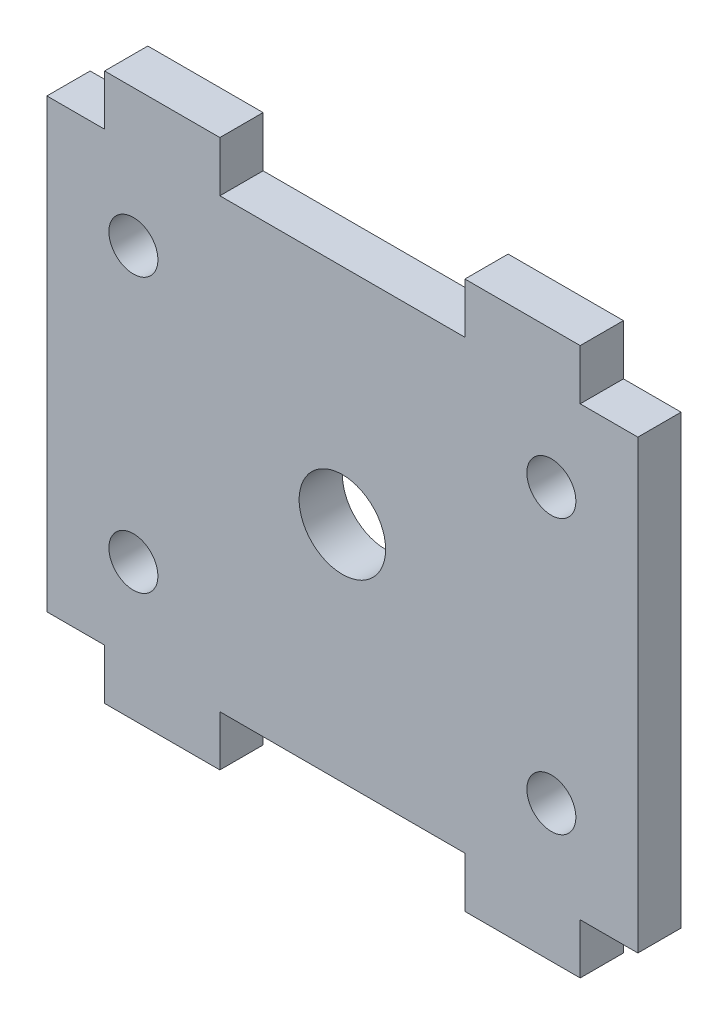
ISO-10303-21;
HEADER;
FILE_DESCRIPTION(('STEP AP214'),'2;1');
FILE_NAME('part.step','',(''),(''),'','','');
FILE_SCHEMA(('AUTOMOTIVE_DESIGN { 1 0 10303 214 1 1 1 1 }'));
ENDSEC;
DATA;
#1=APPLICATION_CONTEXT('core data for automotive mechanical design processes');
#2=APPLICATION_PROTOCOL_DEFINITION('international standard','automotive_design',2000,#1);
#3=PRODUCT_CONTEXT('',#1,'mechanical');
#4=PRODUCT('Part','Part','',(#3));
#5=PRODUCT_RELATED_PRODUCT_CATEGORY('part','',(#4));
#6=PRODUCT_DEFINITION_FORMATION('','',#4);
#7=PRODUCT_DEFINITION_CONTEXT('part definition',#1,'design');
#8=PRODUCT_DEFINITION('design','',#6,#7);
#9=PRODUCT_DEFINITION_SHAPE('','',#8);
#10=(LENGTH_UNIT() NAMED_UNIT(*) SI_UNIT(.MILLI.,.METRE.));
#11=(NAMED_UNIT(*) PLANE_ANGLE_UNIT() SI_UNIT($,.RADIAN.));
#12=(NAMED_UNIT(*) SI_UNIT($,.STERADIAN.) SOLID_ANGLE_UNIT());
#13=UNCERTAINTY_MEASURE_WITH_UNIT(LENGTH_MEASURE(1.E-05),#10,'distance_accuracy_value','');
#14=(GEOMETRIC_REPRESENTATION_CONTEXT(3) GLOBAL_UNCERTAINTY_ASSIGNED_CONTEXT((#13)) GLOBAL_UNIT_ASSIGNED_CONTEXT((#10,
#11,#12)) REPRESENTATION_CONTEXT('',''));
#15=CARTESIAN_POINT('',(0.,0.,0.));
#16=DIRECTION('',(0.,0.,1.));
#17=DIRECTION('',(1.,0.,0.));
#18=AXIS2_PLACEMENT_3D('',#15,#16,#17);
#19=CARTESIAN_POINT('',(0.,0.,3.));
#20=DIRECTION('',(0.,0.,-1.));
#21=DIRECTION('',(-1.,0.,0.));
#22=AXIS2_PLACEMENT_3D('',#19,#20,#21);
#23=PLANE('',#22);
#24=CARTESIAN_POINT('',(-14.5,-9.5,3.));
#25=DIRECTION('',(0.,0.,1.));
#26=DIRECTION('',(1.,0.,0.));
#27=AXIS2_PLACEMENT_3D('',#24,#25,#26);
#28=CIRCLE('',#27,1.7);
#29=CARTESIAN_POINT('',(-12.8,-9.5,3.));
#30=VERTEX_POINT('',#29);
#31=EDGE_CURVE('E365',#30,#30,#28,.T.);
#32=ORIENTED_EDGE('',*,*,#31,.F.);
#33=EDGE_LOOP('',(#32));
#34=FACE_BOUND('',#33,.T.);
#35=CARTESIAN_POINT('',(14.5,9.5,3.));
#36=DIRECTION('',(0.,0.,1.));
#37=DIRECTION('',(1.,0.,0.));
#38=AXIS2_PLACEMENT_3D('',#35,#36,#37);
#39=CIRCLE('',#38,1.7);
#40=CARTESIAN_POINT('',(16.2,9.5,3.));
#41=VERTEX_POINT('',#40);
#42=EDGE_CURVE('E353',#41,#41,#39,.T.);
#43=ORIENTED_EDGE('',*,*,#42,.F.);
#44=EDGE_LOOP('',(#43));
#45=FACE_BOUND('',#44,.T.);
#46=DIRECTION('',(0.,1.,0.));
#47=VECTOR('',#46,1.);
#48=CARTESIAN_POINT('',(-20.5,-15.5,3.));
#49=LINE('',#48,#47);
#50=CARTESIAN_POINT('',(-20.5,-15.5,3.));
#51=VERTEX_POINT('',#50);
#52=CARTESIAN_POINT('',(-20.5,15.5,3.));
#53=VERTEX_POINT('',#52);
#54=EDGE_CURVE('E254',#51,#53,#49,.T.);
#55=ORIENTED_EDGE('',*,*,#54,.F.);
#56=DIRECTION('',(1.,0.,0.));
#57=VECTOR('',#56,1.);
#58=CARTESIAN_POINT('',(-20.5,-15.5,3.));
#59=LINE('',#58,#57);
#60=CARTESIAN_POINT('',(-16.5,-15.5,3.));
#61=VERTEX_POINT('',#60);
#62=EDGE_CURVE('E182',#51,#61,#59,.T.);
#63=ORIENTED_EDGE('',*,*,#62,.T.);
#64=DIRECTION('',(0.,-1.,0.));
#65=VECTOR('',#64,1.);
#66=CARTESIAN_POINT('',(-16.5,-15.5,3.));
#67=LINE('',#66,#65);
#68=CARTESIAN_POINT('',(-16.5,-19.,3.));
#69=VERTEX_POINT('',#68);
#70=EDGE_CURVE('E175',#61,#69,#67,.T.);
#71=ORIENTED_EDGE('',*,*,#70,.T.);
#72=DIRECTION('',(1.,0.,0.));
#73=VECTOR('',#72,1.);
#74=CARTESIAN_POINT('',(-16.5,-19.,3.));
#75=LINE('',#74,#73);
#76=CARTESIAN_POINT('',(-8.5,-19.,3.));
#77=VERTEX_POINT('',#76);
#78=EDGE_CURVE('E180',#69,#77,#75,.T.);
#79=ORIENTED_EDGE('',*,*,#78,.T.);
#80=DIRECTION('',(0.,1.,0.));
#81=VECTOR('',#80,1.);
#82=CARTESIAN_POINT('',(-8.5,-19.,3.));
#83=LINE('',#82,#81);
#84=CARTESIAN_POINT('',(-8.50000000000001,-15.5,3.));
#85=VERTEX_POINT('',#84);
#86=EDGE_CURVE('E197',#77,#85,#83,.T.);
#87=ORIENTED_EDGE('',*,*,#86,.T.);
#88=DIRECTION('',(-1.,0.,0.));
#89=VECTOR('',#88,1.);
#90=CARTESIAN_POINT('',(8.50000000000001,-15.5,3.));
#91=LINE('',#90,#89);
#92=CARTESIAN_POINT('',(8.50000000000001,-15.5,3.));
#93=VERTEX_POINT('',#92);
#94=EDGE_CURVE('E199',#93,#85,#91,.T.);
#95=ORIENTED_EDGE('',*,*,#94,.F.);
#96=DIRECTION('',(0.,1.,0.));
#97=VECTOR('',#96,1.);
#98=CARTESIAN_POINT('',(8.5,-19.,3.));
#99=LINE('',#98,#97);
#100=CARTESIAN_POINT('',(8.5,-19.,3.));
#101=VERTEX_POINT('',#100);
#102=EDGE_CURVE('E304',#101,#93,#99,.T.);
#103=ORIENTED_EDGE('',*,*,#102,.F.);
#104=DIRECTION('',(-1.,0.,0.));
#105=VECTOR('',#104,1.);
#106=CARTESIAN_POINT('',(16.5,-19.,3.));
#107=LINE('',#106,#105);
#108=CARTESIAN_POINT('',(16.5,-19.,3.));
#109=VERTEX_POINT('',#108);
#110=EDGE_CURVE('E311',#109,#101,#107,.T.);
#111=ORIENTED_EDGE('',*,*,#110,.F.);
#112=DIRECTION('',(0.,-1.,0.));
#113=VECTOR('',#112,1.);
#114=CARTESIAN_POINT('',(16.5,-15.5,3.));
#115=LINE('',#114,#113);
#116=CARTESIAN_POINT('',(16.5,-15.5,3.));
#117=VERTEX_POINT('',#116);
#118=EDGE_CURVE('E313',#117,#109,#115,.T.);
#119=ORIENTED_EDGE('',*,*,#118,.F.);
#120=DIRECTION('',(-1.,0.,0.));
#121=VECTOR('',#120,1.);
#122=CARTESIAN_POINT('',(20.5,-15.5,3.));
#123=LINE('',#122,#121);
#124=CARTESIAN_POINT('',(20.5,-15.5,3.));
#125=VERTEX_POINT('',#124);
#126=EDGE_CURVE('E318',#125,#117,#123,.T.);
#127=ORIENTED_EDGE('',*,*,#126,.F.);
#128=DIRECTION('',(0.,1.,0.));
#129=VECTOR('',#128,1.);
#130=CARTESIAN_POINT('',(20.5,-15.5,3.));
#131=LINE('',#130,#129);
#132=CARTESIAN_POINT('',(20.5,15.5,3.));
#133=VERTEX_POINT('',#132);
#134=EDGE_CURVE('E321',#125,#133,#131,.T.);
#135=ORIENTED_EDGE('',*,*,#134,.T.);
#136=DIRECTION('',(-1.,0.,0.));
#137=VECTOR('',#136,1.);
#138=CARTESIAN_POINT('',(20.5,15.5,3.));
#139=LINE('',#138,#137);
#140=CARTESIAN_POINT('',(16.5,15.5,3.));
#141=VERTEX_POINT('',#140);
#142=EDGE_CURVE('E323',#133,#141,#139,.T.);
#143=ORIENTED_EDGE('',*,*,#142,.T.);
#144=DIRECTION('',(0.,1.,0.));
#145=VECTOR('',#144,1.);
#146=CARTESIAN_POINT('',(16.5,15.5,3.));
#147=LINE('',#146,#145);
#148=CARTESIAN_POINT('',(16.5,19.,3.));
#149=VERTEX_POINT('',#148);
#150=EDGE_CURVE('E325',#141,#149,#147,.T.);
#151=ORIENTED_EDGE('',*,*,#150,.T.);
#152=DIRECTION('',(-1.,0.,0.));
#153=VECTOR('',#152,1.);
#154=CARTESIAN_POINT('',(16.5,19.,3.));
#155=LINE('',#154,#153);
#156=CARTESIAN_POINT('',(8.5,19.,3.));
#157=VERTEX_POINT('',#156);
#158=EDGE_CURVE('E327',#149,#157,#155,.T.);
#159=ORIENTED_EDGE('',*,*,#158,.T.);
#160=DIRECTION('',(0.,-1.,0.));
#161=VECTOR('',#160,1.);
#162=CARTESIAN_POINT('',(8.5,19.,3.));
#163=LINE('',#162,#161);
#164=CARTESIAN_POINT('',(8.50000000000001,15.5,3.));
#165=VERTEX_POINT('',#164);
#166=EDGE_CURVE('E329',#157,#165,#163,.T.);
#167=ORIENTED_EDGE('',*,*,#166,.T.);
#168=DIRECTION('',(-1.,0.,0.));
#169=VECTOR('',#168,1.);
#170=CARTESIAN_POINT('',(8.50000000000001,15.5,3.));
#171=LINE('',#170,#169);
#172=CARTESIAN_POINT('',(-8.50000000000001,15.5,3.));
#173=VERTEX_POINT('',#172);
#174=EDGE_CURVE('E331',#165,#173,#171,.T.);
#175=ORIENTED_EDGE('',*,*,#174,.T.);
#176=DIRECTION('',(0.,-1.,0.));
#177=VECTOR('',#176,1.);
#178=CARTESIAN_POINT('',(-8.5,19.,3.));
#179=LINE('',#178,#177);
#180=CARTESIAN_POINT('',(-8.5,19.,3.));
#181=VERTEX_POINT('',#180);
#182=EDGE_CURVE('E333',#181,#173,#179,.T.);
#183=ORIENTED_EDGE('',*,*,#182,.F.);
#184=DIRECTION('',(1.,0.,0.));
#185=VECTOR('',#184,1.);
#186=CARTESIAN_POINT('',(-16.5,19.,3.));
#187=LINE('',#186,#185);
#188=CARTESIAN_POINT('',(-16.5,19.,3.));
#189=VERTEX_POINT('',#188);
#190=EDGE_CURVE('E336',#189,#181,#187,.T.);
#191=ORIENTED_EDGE('',*,*,#190,.F.);
#192=DIRECTION('',(0.,1.,0.));
#193=VECTOR('',#192,1.);
#194=CARTESIAN_POINT('',(-16.5,15.5,3.));
#195=LINE('',#194,#193);
#196=CARTESIAN_POINT('',(-16.5,15.5,3.));
#197=VERTEX_POINT('',#196);
#198=EDGE_CURVE('E339',#197,#189,#195,.T.);
#199=ORIENTED_EDGE('',*,*,#198,.F.);
#200=DIRECTION('',(1.,0.,0.));
#201=VECTOR('',#200,1.);
#202=CARTESIAN_POINT('',(-20.5,15.5,3.));
#203=LINE('',#202,#201);
#204=EDGE_CURVE('E342',#53,#197,#203,.T.);
#205=ORIENTED_EDGE('',*,*,#204,.F.);
#206=EDGE_LOOP('',(#55,#63,#71,#79,#87,#95,#103,#111,#119,#127,#135,#143,#151,#159,#167,#175,
#183,#191,#199,#205));
#207=FACE_BOUND('',#206,.T.);
#208=CARTESIAN_POINT('',(0.,0.,3.));
#209=DIRECTION('',(0.,0.,1.));
#210=DIRECTION('',(1.,0.,0.));
#211=AXIS2_PLACEMENT_3D('',#208,#209,#210);
#212=CIRCLE('',#211,3.);
#213=CARTESIAN_POINT('',(3.,0.,3.));
#214=VERTEX_POINT('',#213);
#215=EDGE_CURVE('E347',#214,#214,#212,.T.);
#216=ORIENTED_EDGE('',*,*,#215,.F.);
#217=EDGE_LOOP('',(#216));
#218=FACE_BOUND('',#217,.T.);
#219=CARTESIAN_POINT('',(-14.5,9.5,3.));
#220=DIRECTION('',(0.,0.,1.));
#221=DIRECTION('',(1.,0.,0.));
#222=AXIS2_PLACEMENT_3D('',#219,#220,#221);
#223=CIRCLE('',#222,1.7);
#224=CARTESIAN_POINT('',(-12.8,9.5,3.));
#225=VERTEX_POINT('',#224);
#226=EDGE_CURVE('E359',#225,#225,#223,.T.);
#227=ORIENTED_EDGE('',*,*,#226,.F.);
#228=EDGE_LOOP('',(#227));
#229=FACE_BOUND('',#228,.T.);
#230=CARTESIAN_POINT('',(14.5,-9.5,3.));
#231=DIRECTION('',(0.,0.,1.));
#232=DIRECTION('',(1.,0.,0.));
#233=AXIS2_PLACEMENT_3D('',#230,#231,#232);
#234=CIRCLE('',#233,1.7);
#235=CARTESIAN_POINT('',(16.2,-9.5,3.));
#236=VERTEX_POINT('',#235);
#237=EDGE_CURVE('E371',#236,#236,#234,.T.);
#238=ORIENTED_EDGE('',*,*,#237,.F.);
#239=EDGE_LOOP('',(#238));
#240=FACE_BOUND('',#239,.T.);
#241=ADVANCED_FACE('F33',(#34,#45,#207,#218,#229,#240),#23,.F.);
#242=CARTESIAN_POINT('',(-20.5,-15.5,3.));
#243=DIRECTION('',(-1.,0.,0.));
#244=DIRECTION('',(0.,-1.,0.));
#245=AXIS2_PLACEMENT_3D('',#242,#243,#244);
#246=PLANE('',#245);
#247=DIRECTION('',(0.,1.,0.));
#248=VECTOR('',#247,1.);
#249=CARTESIAN_POINT('',(-20.5,-15.5,0.));
#250=LINE('',#249,#248);
#251=CARTESIAN_POINT('',(-20.5,-15.5,0.));
#252=VERTEX_POINT('',#251);
#253=CARTESIAN_POINT('',(-20.5,15.5,0.));
#254=VERTEX_POINT('',#253);
#255=EDGE_CURVE('E204',#252,#254,#250,.T.);
#256=ORIENTED_EDGE('',*,*,#255,.F.);
#257=DIRECTION('',(0.,0.,-1.));
#258=VECTOR('',#257,1.);
#259=CARTESIAN_POINT('',(-20.5,-15.5,3.));
#260=LINE('',#259,#258);
#261=EDGE_CURVE('E11',#51,#252,#260,.T.);
#262=ORIENTED_EDGE('',*,*,#261,.F.);
#263=ORIENTED_EDGE('',*,*,#54,.T.);
#264=DIRECTION('',(0.,0.,-1.));
#265=VECTOR('',#264,1.);
#266=CARTESIAN_POINT('',(-20.5,15.5,3.));
#267=LINE('',#266,#265);
#268=EDGE_CURVE('E37',#53,#254,#267,.T.);
#269=ORIENTED_EDGE('',*,*,#268,.T.);
#270=EDGE_LOOP('',(#256,#262,#263,#269));
#271=FACE_BOUND('',#270,.T.);
#272=ADVANCED_FACE('F35',(#271),#246,.T.);
#273=CARTESIAN_POINT('',(-20.5,-15.5,3.));
#274=DIRECTION('',(0.,1.,0.));
#275=DIRECTION('',(0.,0.,1.));
#276=AXIS2_PLACEMENT_3D('',#273,#274,#275);
#277=PLANE('',#276);
#278=DIRECTION('',(1.,0.,0.));
#279=VECTOR('',#278,1.);
#280=CARTESIAN_POINT('',(-20.5,-15.5,0.));
#281=LINE('',#280,#279);
#282=CARTESIAN_POINT('',(-16.5,-15.5,0.));
#283=VERTEX_POINT('',#282);
#284=EDGE_CURVE('E115',#252,#283,#281,.T.);
#285=ORIENTED_EDGE('',*,*,#284,.T.);
#286=DIRECTION('',(0.,0.,-1.));
#287=VECTOR('',#286,1.);
#288=CARTESIAN_POINT('',(-16.5,-15.5,3.));
#289=LINE('',#288,#287);
#290=EDGE_CURVE('E43',#61,#283,#289,.T.);
#291=ORIENTED_EDGE('',*,*,#290,.F.);
#292=ORIENTED_EDGE('',*,*,#62,.F.);
#293=ORIENTED_EDGE('',*,*,#261,.T.);
#294=EDGE_LOOP('',(#285,#291,#292,#293));
#295=FACE_BOUND('',#294,.T.);
#296=ADVANCED_FACE('F386',(#295),#277,.F.);
#297=CARTESIAN_POINT('',(-16.5,-15.5,3.));
#298=DIRECTION('',(1.,0.,0.));
#299=DIRECTION('',(0.,1.,0.));
#300=AXIS2_PLACEMENT_3D('',#297,#298,#299);
#301=PLANE('',#300);
#302=DIRECTION('',(0.,-1.,0.));
#303=VECTOR('',#302,1.);
#304=CARTESIAN_POINT('',(-16.5,-15.5,0.));
#305=LINE('',#304,#303);
#306=CARTESIAN_POINT('',(-16.5,-19.,0.));
#307=VERTEX_POINT('',#306);
#308=EDGE_CURVE('E189',#283,#307,#305,.T.);
#309=ORIENTED_EDGE('',*,*,#308,.T.);
#310=DIRECTION('',(0.,0.,-1.));
#311=VECTOR('',#310,1.);
#312=CARTESIAN_POINT('',(-16.5,-19.,3.));
#313=LINE('',#312,#311);
#314=EDGE_CURVE('E186',#69,#307,#313,.T.);
#315=ORIENTED_EDGE('',*,*,#314,.F.);
#316=ORIENTED_EDGE('',*,*,#70,.F.);
#317=ORIENTED_EDGE('',*,*,#290,.T.);
#318=EDGE_LOOP('',(#309,#315,#316,#317));
#319=FACE_BOUND('',#318,.T.);
#320=ADVANCED_FACE('F187',(#319),#301,.F.);
#321=CARTESIAN_POINT('',(-16.5,-19.,3.));
#322=DIRECTION('',(0.,1.,0.));
#323=DIRECTION('',(-1.,0.,0.));
#324=AXIS2_PLACEMENT_3D('',#321,#322,#323);
#325=PLANE('',#324);
#326=DIRECTION('',(1.,0.,0.));
#327=VECTOR('',#326,1.);
#328=CARTESIAN_POINT('',(-16.5,-19.,0.));
#329=LINE('',#328,#327);
#330=CARTESIAN_POINT('',(-8.5,-19.,0.));
#331=VERTEX_POINT('',#330);
#332=EDGE_CURVE('E251',#307,#331,#329,.T.);
#333=ORIENTED_EDGE('',*,*,#332,.T.);
#334=DIRECTION('',(0.,0.,-1.));
#335=VECTOR('',#334,1.);
#336=CARTESIAN_POINT('',(-8.5,-19.,3.));
#337=LINE('',#336,#335);
#338=EDGE_CURVE('E192',#77,#331,#337,.T.);
#339=ORIENTED_EDGE('',*,*,#338,.F.);
#340=ORIENTED_EDGE('',*,*,#78,.F.);
#341=ORIENTED_EDGE('',*,*,#314,.T.);
#342=EDGE_LOOP('',(#333,#339,#340,#341));
#343=FACE_BOUND('',#342,.T.);
#344=ADVANCED_FACE('F194',(#343),#325,.F.);
#345=CARTESIAN_POINT('',(-8.5,-19.,3.));
#346=DIRECTION('',(-1.,0.,0.));
#347=DIRECTION('',(0.,-1.,0.));
#348=AXIS2_PLACEMENT_3D('',#345,#346,#347);
#349=PLANE('',#348);
#350=DIRECTION('',(0.,1.,0.));
#351=VECTOR('',#350,1.);
#352=CARTESIAN_POINT('',(-8.5,-19.,0.));
#353=LINE('',#352,#351);
#354=CARTESIAN_POINT('',(-8.50000000000001,-15.5,0.));
#355=VERTEX_POINT('',#354);
#356=EDGE_CURVE('E248',#331,#355,#353,.T.);
#357=ORIENTED_EDGE('',*,*,#356,.T.);
#358=DIRECTION('',(0.,0.,-1.));
#359=VECTOR('',#358,1.);
#360=CARTESIAN_POINT('',(-8.50000000000001,-15.5,3.));
#361=LINE('',#360,#359);
#362=EDGE_CURVE('E258',#85,#355,#361,.T.);
#363=ORIENTED_EDGE('',*,*,#362,.F.);
#364=ORIENTED_EDGE('',*,*,#86,.F.);
#365=ORIENTED_EDGE('',*,*,#338,.T.);
#366=EDGE_LOOP('',(#357,#363,#364,#365));
#367=FACE_BOUND('',#366,.T.);
#368=ADVANCED_FACE('F297',(#367),#349,.F.);
#369=CARTESIAN_POINT('',(8.50000000000001,-15.5,3.));
#370=DIRECTION('',(0.,-1.,0.));
#371=DIRECTION('',(0.,0.,-1.));
#372=AXIS2_PLACEMENT_3D('',#369,#370,#371);
#373=PLANE('',#372);
#374=DIRECTION('',(-1.,0.,0.));
#375=VECTOR('',#374,1.);
#376=CARTESIAN_POINT('',(8.50000000000001,-15.5,0.));
#377=LINE('',#376,#375);
#378=CARTESIAN_POINT('',(8.50000000000001,-15.5,0.));
#379=VERTEX_POINT('',#378);
#380=EDGE_CURVE('E245',#379,#355,#377,.T.);
#381=ORIENTED_EDGE('',*,*,#380,.F.);
#382=DIRECTION('',(0.,0.,-1.));
#383=VECTOR('',#382,1.);
#384=CARTESIAN_POINT('',(8.50000000000001,-15.5,3.));
#385=LINE('',#384,#383);
#386=EDGE_CURVE('E260',#93,#379,#385,.T.);
#387=ORIENTED_EDGE('',*,*,#386,.F.);
#388=ORIENTED_EDGE('',*,*,#94,.T.);
#389=ORIENTED_EDGE('',*,*,#362,.T.);
#390=EDGE_LOOP('',(#381,#387,#388,#389));
#391=FACE_BOUND('',#390,.T.);
#392=ADVANCED_FACE('F403',(#391),#373,.T.);
#393=CARTESIAN_POINT('',(8.5,-19.,3.));
#394=DIRECTION('',(-1.,0.,0.));
#395=DIRECTION('',(0.,-1.,0.));
#396=AXIS2_PLACEMENT_3D('',#393,#394,#395);
#397=PLANE('',#396);
#398=DIRECTION('',(0.,1.,0.));
#399=VECTOR('',#398,1.);
#400=CARTESIAN_POINT('',(8.5,-19.,0.));
#401=LINE('',#400,#399);
#402=CARTESIAN_POINT('',(8.5,-19.,0.));
#403=VERTEX_POINT('',#402);
#404=EDGE_CURVE('E242',#403,#379,#401,.T.);
#405=ORIENTED_EDGE('',*,*,#404,.F.);
#406=DIRECTION('',(0.,0.,-1.));
#407=VECTOR('',#406,1.);
#408=CARTESIAN_POINT('',(8.5,-19.,3.));
#409=LINE('',#408,#407);
#410=EDGE_CURVE('E262',#101,#403,#409,.T.);
#411=ORIENTED_EDGE('',*,*,#410,.F.);
#412=ORIENTED_EDGE('',*,*,#102,.T.);
#413=ORIENTED_EDGE('',*,*,#386,.T.);
#414=EDGE_LOOP('',(#405,#411,#412,#413));
#415=FACE_BOUND('',#414,.T.);
#416=ADVANCED_FACE('F309',(#415),#397,.T.);
#417=CARTESIAN_POINT('',(16.5,-19.,3.));
#418=DIRECTION('',(0.,-1.,0.));
#419=DIRECTION('',(1.,0.,0.));
#420=AXIS2_PLACEMENT_3D('',#417,#418,#419);
#421=PLANE('',#420);
#422=DIRECTION('',(-1.,0.,0.));
#423=VECTOR('',#422,1.);
#424=CARTESIAN_POINT('',(16.5,-19.,0.));
#425=LINE('',#424,#423);
#426=CARTESIAN_POINT('',(16.5,-19.,0.));
#427=VERTEX_POINT('',#426);
#428=EDGE_CURVE('E239',#427,#403,#425,.T.);
#429=ORIENTED_EDGE('',*,*,#428,.F.);
#430=DIRECTION('',(0.,0.,-1.));
#431=VECTOR('',#430,1.);
#432=CARTESIAN_POINT('',(16.5,-19.,3.));
#433=LINE('',#432,#431);
#434=EDGE_CURVE('E264',#109,#427,#433,.T.);
#435=ORIENTED_EDGE('',*,*,#434,.F.);
#436=ORIENTED_EDGE('',*,*,#110,.T.);
#437=ORIENTED_EDGE('',*,*,#410,.T.);
#438=EDGE_LOOP('',(#429,#435,#436,#437));
#439=FACE_BOUND('',#438,.T.);
#440=ADVANCED_FACE('F408',(#439),#421,.T.);
#441=CARTESIAN_POINT('',(16.5,-15.5,3.));
#442=DIRECTION('',(1.,0.,0.));
#443=DIRECTION('',(0.,1.,0.));
#444=AXIS2_PLACEMENT_3D('',#441,#442,#443);
#445=PLANE('',#444);
#446=DIRECTION('',(0.,-1.,0.));
#447=VECTOR('',#446,1.);
#448=CARTESIAN_POINT('',(16.5,-15.5,0.));
#449=LINE('',#448,#447);
#450=CARTESIAN_POINT('',(16.5,-15.5,0.));
#451=VERTEX_POINT('',#450);
#452=EDGE_CURVE('E236',#451,#427,#449,.T.);
#453=ORIENTED_EDGE('',*,*,#452,.F.);
#454=DIRECTION('',(0.,0.,-1.));
#455=VECTOR('',#454,1.);
#456=CARTESIAN_POINT('',(16.5,-15.5,3.));
#457=LINE('',#456,#455);
#458=EDGE_CURVE('E266',#117,#451,#457,.T.);
#459=ORIENTED_EDGE('',*,*,#458,.F.);
#460=ORIENTED_EDGE('',*,*,#118,.T.);
#461=ORIENTED_EDGE('',*,*,#434,.T.);
#462=EDGE_LOOP('',(#453,#459,#460,#461));
#463=FACE_BOUND('',#462,.T.);
#464=ADVANCED_FACE('F411',(#463),#445,.T.);
#465=CARTESIAN_POINT('',(20.5,-15.5,3.));
#466=DIRECTION('',(0.,-1.,0.));
#467=DIRECTION('',(0.,0.,-1.));
#468=AXIS2_PLACEMENT_3D('',#465,#466,#467);
#469=PLANE('',#468);
#470=DIRECTION('',(-1.,0.,0.));
#471=VECTOR('',#470,1.);
#472=CARTESIAN_POINT('',(20.5,-15.5,0.));
#473=LINE('',#472,#471);
#474=CARTESIAN_POINT('',(20.5,-15.5,0.));
#475=VERTEX_POINT('',#474);
#476=EDGE_CURVE('E233',#475,#451,#473,.T.);
#477=ORIENTED_EDGE('',*,*,#476,.F.);
#478=DIRECTION('',(0.,0.,-1.));
#479=VECTOR('',#478,1.);
#480=CARTESIAN_POINT('',(20.5,-15.5,3.));
#481=LINE('',#480,#479);
#482=EDGE_CURVE('E268',#125,#475,#481,.T.);
#483=ORIENTED_EDGE('',*,*,#482,.F.);
#484=ORIENTED_EDGE('',*,*,#126,.T.);
#485=ORIENTED_EDGE('',*,*,#458,.T.);
#486=EDGE_LOOP('',(#477,#483,#484,#485));
#487=FACE_BOUND('',#486,.T.);
#488=ADVANCED_FACE('F415',(#487),#469,.T.);
#489=CARTESIAN_POINT('',(20.5,-15.5,3.));
#490=DIRECTION('',(-1.,0.,0.));
#491=DIRECTION('',(0.,0.,1.));
#492=AXIS2_PLACEMENT_3D('',#489,#490,#491);
#493=PLANE('',#492);
#494=DIRECTION('',(0.,1.,0.));
#495=VECTOR('',#494,1.);
#496=CARTESIAN_POINT('',(20.5,-15.5,0.));
#497=LINE('',#496,#495);
#498=CARTESIAN_POINT('',(20.5,15.5,0.));
#499=VERTEX_POINT('',#498);
#500=EDGE_CURVE('E231',#475,#499,#497,.T.);
#501=ORIENTED_EDGE('',*,*,#500,.T.);
#502=DIRECTION('',(0.,0.,-1.));
#503=VECTOR('',#502,1.);
#504=CARTESIAN_POINT('',(20.5,15.5,3.));
#505=LINE('',#504,#503);
#506=EDGE_CURVE('E270',#133,#499,#505,.T.);
#507=ORIENTED_EDGE('',*,*,#506,.F.);
#508=ORIENTED_EDGE('',*,*,#134,.F.);
#509=ORIENTED_EDGE('',*,*,#482,.T.);
#510=EDGE_LOOP('',(#501,#507,#508,#509));
#511=FACE_BOUND('',#510,.T.);
#512=ADVANCED_FACE('F419',(#511),#493,.F.);
#513=CARTESIAN_POINT('',(20.5,15.5,3.));
#514=DIRECTION('',(0.,-1.,0.));
#515=DIRECTION('',(0.,0.,-1.));
#516=AXIS2_PLACEMENT_3D('',#513,#514,#515);
#517=PLANE('',#516);
#518=DIRECTION('',(-1.,0.,0.));
#519=VECTOR('',#518,1.);
#520=CARTESIAN_POINT('',(20.5,15.5,0.));
#521=LINE('',#520,#519);
#522=CARTESIAN_POINT('',(16.5,15.5,0.));
#523=VERTEX_POINT('',#522);
#524=EDGE_CURVE('E229',#499,#523,#521,.T.);
#525=ORIENTED_EDGE('',*,*,#524,.T.);
#526=DIRECTION('',(0.,0.,-1.));
#527=VECTOR('',#526,1.);
#528=CARTESIAN_POINT('',(16.5,15.5,3.));
#529=LINE('',#528,#527);
#530=EDGE_CURVE('E273',#141,#523,#529,.T.);
#531=ORIENTED_EDGE('',*,*,#530,.F.);
#532=ORIENTED_EDGE('',*,*,#142,.F.);
#533=ORIENTED_EDGE('',*,*,#506,.T.);
#534=EDGE_LOOP('',(#525,#531,#532,#533));
#535=FACE_BOUND('',#534,.T.);
#536=ADVANCED_FACE('F423',(#535),#517,.F.);
#537=CARTESIAN_POINT('',(16.5,15.5,3.));
#538=DIRECTION('',(-1.,0.,0.));
#539=DIRECTION('',(0.,-1.,0.));
#540=AXIS2_PLACEMENT_3D('',#537,#538,#539);
#541=PLANE('',#540);
#542=DIRECTION('',(0.,1.,0.));
#543=VECTOR('',#542,1.);
#544=CARTESIAN_POINT('',(16.5,15.5,0.));
#545=LINE('',#544,#543);
#546=CARTESIAN_POINT('',(16.5,19.,0.));
#547=VERTEX_POINT('',#546);
#548=EDGE_CURVE('E227',#523,#547,#545,.T.);
#549=ORIENTED_EDGE('',*,*,#548,.T.);
#550=DIRECTION('',(0.,0.,-1.));
#551=VECTOR('',#550,1.);
#552=CARTESIAN_POINT('',(16.5,19.,3.));
#553=LINE('',#552,#551);
#554=EDGE_CURVE('E276',#149,#547,#553,.T.);
#555=ORIENTED_EDGE('',*,*,#554,.F.);
#556=ORIENTED_EDGE('',*,*,#150,.F.);
#557=ORIENTED_EDGE('',*,*,#530,.T.);
#558=EDGE_LOOP('',(#549,#555,#556,#557));
#559=FACE_BOUND('',#558,.T.);
#560=ADVANCED_FACE('F427',(#559),#541,.F.);
#561=CARTESIAN_POINT('',(16.5,19.,3.));
#562=DIRECTION('',(0.,-1.,0.));
#563=DIRECTION('',(1.,0.,0.));
#564=AXIS2_PLACEMENT_3D('',#561,#562,#563);
#565=PLANE('',#564);
#566=DIRECTION('',(-1.,0.,0.));
#567=VECTOR('',#566,1.);
#568=CARTESIAN_POINT('',(16.5,19.,0.));
#569=LINE('',#568,#567);
#570=CARTESIAN_POINT('',(8.5,19.,0.));
#571=VERTEX_POINT('',#570);
#572=EDGE_CURVE('E225',#547,#571,#569,.T.);
#573=ORIENTED_EDGE('',*,*,#572,.T.);
#574=DIRECTION('',(0.,0.,-1.));
#575=VECTOR('',#574,1.);
#576=CARTESIAN_POINT('',(8.5,19.,3.));
#577=LINE('',#576,#575);
#578=EDGE_CURVE('E279',#157,#571,#577,.T.);
#579=ORIENTED_EDGE('',*,*,#578,.F.);
#580=ORIENTED_EDGE('',*,*,#158,.F.);
#581=ORIENTED_EDGE('',*,*,#554,.T.);
#582=EDGE_LOOP('',(#573,#579,#580,#581));
#583=FACE_BOUND('',#582,.T.);
#584=ADVANCED_FACE('F431',(#583),#565,.F.);
#585=CARTESIAN_POINT('',(8.5,19.,3.));
#586=DIRECTION('',(1.,0.,0.));
#587=DIRECTION('',(0.,1.,0.));
#588=AXIS2_PLACEMENT_3D('',#585,#586,#587);
#589=PLANE('',#588);
#590=DIRECTION('',(0.,-1.,0.));
#591=VECTOR('',#590,1.);
#592=CARTESIAN_POINT('',(8.5,19.,0.));
#593=LINE('',#592,#591);
#594=CARTESIAN_POINT('',(8.50000000000001,15.5,0.));
#595=VERTEX_POINT('',#594);
#596=EDGE_CURVE('E223',#571,#595,#593,.T.);
#597=ORIENTED_EDGE('',*,*,#596,.T.);
#598=DIRECTION('',(0.,0.,-1.));
#599=VECTOR('',#598,1.);
#600=CARTESIAN_POINT('',(8.50000000000001,15.5,3.));
#601=LINE('',#600,#599);
#602=EDGE_CURVE('E282',#165,#595,#601,.T.);
#603=ORIENTED_EDGE('',*,*,#602,.F.);
#604=ORIENTED_EDGE('',*,*,#166,.F.);
#605=ORIENTED_EDGE('',*,*,#578,.T.);
#606=EDGE_LOOP('',(#597,#603,#604,#605));
#607=FACE_BOUND('',#606,.T.);
#608=ADVANCED_FACE('F435',(#607),#589,.F.);
#609=CARTESIAN_POINT('',(8.50000000000001,15.5,3.));
#610=DIRECTION('',(0.,-1.,0.));
#611=DIRECTION('',(1.,0.,0.));
#612=AXIS2_PLACEMENT_3D('',#609,#610,#611);
#613=PLANE('',#612);
#614=DIRECTION('',(-1.,0.,0.));
#615=VECTOR('',#614,1.);
#616=CARTESIAN_POINT('',(8.50000000000001,15.5,0.));
#617=LINE('',#616,#615);
#618=CARTESIAN_POINT('',(-8.50000000000001,15.5,0.));
#619=VERTEX_POINT('',#618);
#620=EDGE_CURVE('E220',#595,#619,#617,.T.);
#621=ORIENTED_EDGE('',*,*,#620,.T.);
#622=DIRECTION('',(0.,0.,-1.));
#623=VECTOR('',#622,1.);
#624=CARTESIAN_POINT('',(-8.50000000000001,15.5,3.));
#625=LINE('',#624,#623);
#626=EDGE_CURVE('E285',#173,#619,#625,.T.);
#627=ORIENTED_EDGE('',*,*,#626,.F.);
#628=ORIENTED_EDGE('',*,*,#174,.F.);
#629=ORIENTED_EDGE('',*,*,#602,.T.);
#630=EDGE_LOOP('',(#621,#627,#628,#629));
#631=FACE_BOUND('',#630,.T.);
#632=ADVANCED_FACE('F439',(#631),#613,.F.);
#633=CARTESIAN_POINT('',(-8.5,19.,3.));
#634=DIRECTION('',(1.,0.,0.));
#635=DIRECTION('',(0.,1.,0.));
#636=AXIS2_PLACEMENT_3D('',#633,#634,#635);
#637=PLANE('',#636);
#638=DIRECTION('',(0.,-1.,0.));
#639=VECTOR('',#638,1.);
#640=CARTESIAN_POINT('',(-8.5,19.,0.));
#641=LINE('',#640,#639);
#642=CARTESIAN_POINT('',(-8.5,19.,0.));
#643=VERTEX_POINT('',#642);
#644=EDGE_CURVE('E217',#643,#619,#641,.T.);
#645=ORIENTED_EDGE('',*,*,#644,.F.);
#646=DIRECTION('',(0.,0.,-1.));
#647=VECTOR('',#646,1.);
#648=CARTESIAN_POINT('',(-8.5,19.,3.));
#649=LINE('',#648,#647);
#650=EDGE_CURVE('E287',#181,#643,#649,.T.);
#651=ORIENTED_EDGE('',*,*,#650,.F.);
#652=ORIENTED_EDGE('',*,*,#182,.T.);
#653=ORIENTED_EDGE('',*,*,#626,.T.);
#654=EDGE_LOOP('',(#645,#651,#652,#653));
#655=FACE_BOUND('',#654,.T.);
#656=ADVANCED_FACE('F443',(#655),#637,.T.);
#657=CARTESIAN_POINT('',(-16.5,19.,3.));
#658=DIRECTION('',(0.,1.,0.));
#659=DIRECTION('',(0.,0.,1.));
#660=AXIS2_PLACEMENT_3D('',#657,#658,#659);
#661=PLANE('',#660);
#662=DIRECTION('',(1.,0.,0.));
#663=VECTOR('',#662,1.);
#664=CARTESIAN_POINT('',(-16.5,19.,0.));
#665=LINE('',#664,#663);
#666=CARTESIAN_POINT('',(-16.5,19.,0.));
#667=VERTEX_POINT('',#666);
#668=EDGE_CURVE('E214',#667,#643,#665,.T.);
#669=ORIENTED_EDGE('',*,*,#668,.F.);
#670=DIRECTION('',(0.,0.,-1.));
#671=VECTOR('',#670,1.);
#672=CARTESIAN_POINT('',(-16.5,19.,3.));
#673=LINE('',#672,#671);
#674=EDGE_CURVE('E289',#189,#667,#673,.T.);
#675=ORIENTED_EDGE('',*,*,#674,.F.);
#676=ORIENTED_EDGE('',*,*,#190,.T.);
#677=ORIENTED_EDGE('',*,*,#650,.T.);
#678=EDGE_LOOP('',(#669,#675,#676,#677));
#679=FACE_BOUND('',#678,.T.);
#680=ADVANCED_FACE('F447',(#679),#661,.T.);
#681=CARTESIAN_POINT('',(-16.5,15.5,3.));
#682=DIRECTION('',(-1.,0.,0.));
#683=DIRECTION('',(0.,-1.,0.));
#684=AXIS2_PLACEMENT_3D('',#681,#682,#683);
#685=PLANE('',#684);
#686=DIRECTION('',(0.,1.,0.));
#687=VECTOR('',#686,1.);
#688=CARTESIAN_POINT('',(-16.5,15.5,0.));
#689=LINE('',#688,#687);
#690=CARTESIAN_POINT('',(-16.5,15.5,0.));
#691=VERTEX_POINT('',#690);
#692=EDGE_CURVE('E211',#691,#667,#689,.T.);
#693=ORIENTED_EDGE('',*,*,#692,.F.);
#694=DIRECTION('',(0.,0.,-1.));
#695=VECTOR('',#694,1.);
#696=CARTESIAN_POINT('',(-16.5,15.5,3.));
#697=LINE('',#696,#695);
#698=EDGE_CURVE('E290',#197,#691,#697,.T.);
#699=ORIENTED_EDGE('',*,*,#698,.F.);
#700=ORIENTED_EDGE('',*,*,#198,.T.);
#701=ORIENTED_EDGE('',*,*,#674,.T.);
#702=EDGE_LOOP('',(#693,#699,#700,#701));
#703=FACE_BOUND('',#702,.T.);
#704=ADVANCED_FACE('F451',(#703),#685,.T.);
#705=CARTESIAN_POINT('',(-20.5,15.5,3.));
#706=DIRECTION('',(0.,1.,0.));
#707=DIRECTION('',(-1.,0.,0.));
#708=AXIS2_PLACEMENT_3D('',#705,#706,#707);
#709=PLANE('',#708);
#710=DIRECTION('',(1.,0.,0.));
#711=VECTOR('',#710,1.);
#712=CARTESIAN_POINT('',(-20.5,15.5,0.));
#713=LINE('',#712,#711);
#714=EDGE_CURVE('E207',#254,#691,#713,.T.);
#715=ORIENTED_EDGE('',*,*,#714,.F.);
#716=ORIENTED_EDGE('',*,*,#268,.F.);
#717=ORIENTED_EDGE('',*,*,#204,.T.);
#718=ORIENTED_EDGE('',*,*,#698,.T.);
#719=EDGE_LOOP('',(#715,#716,#717,#718));
#720=FACE_BOUND('',#719,.T.);
#721=ADVANCED_FACE('F292',(#720),#709,.T.);
#722=CARTESIAN_POINT('',(0.,0.,0.));
#723=DIRECTION('',(0.,0.,-1.));
#724=DIRECTION('',(-1.,0.,0.));
#725=AXIS2_PLACEMENT_3D('',#722,#723,#724);
#726=PLANE('',#725);
#727=CARTESIAN_POINT('',(14.5,-9.5,0.));
#728=DIRECTION('',(0.,0.,-1.));
#729=DIRECTION('',(-1.,0.,0.));
#730=AXIS2_PLACEMENT_3D('',#727,#728,#729);
#731=CIRCLE('',#730,1.7);
#732=CARTESIAN_POINT('',(12.8,-9.5,0.));
#733=VERTEX_POINT('',#732);
#734=EDGE_CURVE('E368',#733,#733,#731,.T.);
#735=ORIENTED_EDGE('',*,*,#734,.F.);
#736=EDGE_LOOP('',(#735));
#737=FACE_BOUND('',#736,.T.);
#738=CARTESIAN_POINT('',(-14.5,-9.5,0.));
#739=DIRECTION('',(0.,0.,-1.));
#740=DIRECTION('',(-1.,0.,0.));
#741=AXIS2_PLACEMENT_3D('',#738,#739,#740);
#742=CIRCLE('',#741,1.7);
#743=CARTESIAN_POINT('',(-16.2,-9.5,0.));
#744=VERTEX_POINT('',#743);
#745=EDGE_CURVE('E362',#744,#744,#742,.T.);
#746=ORIENTED_EDGE('',*,*,#745,.F.);
#747=EDGE_LOOP('',(#746));
#748=FACE_BOUND('',#747,.T.);
#749=CARTESIAN_POINT('',(-14.5,9.5,0.));
#750=DIRECTION('',(0.,0.,-1.));
#751=DIRECTION('',(-1.,0.,0.));
#752=AXIS2_PLACEMENT_3D('',#749,#750,#751);
#753=CIRCLE('',#752,1.7);
#754=CARTESIAN_POINT('',(-16.2,9.5,0.));
#755=VERTEX_POINT('',#754);
#756=EDGE_CURVE('E356',#755,#755,#753,.T.);
#757=ORIENTED_EDGE('',*,*,#756,.F.);
#758=EDGE_LOOP('',(#757));
#759=FACE_BOUND('',#758,.T.);
#760=CARTESIAN_POINT('',(14.5,9.5,0.));
#761=DIRECTION('',(0.,0.,-1.));
#762=DIRECTION('',(-1.,0.,0.));
#763=AXIS2_PLACEMENT_3D('',#760,#761,#762);
#764=CIRCLE('',#763,1.7);
#765=CARTESIAN_POINT('',(12.8,9.5,0.));
#766=VERTEX_POINT('',#765);
#767=EDGE_CURVE('E350',#766,#766,#764,.T.);
#768=ORIENTED_EDGE('',*,*,#767,.F.);
#769=EDGE_LOOP('',(#768));
#770=FACE_BOUND('',#769,.T.);
#771=CARTESIAN_POINT('',(0.,0.,0.));
#772=DIRECTION('',(0.,0.,-1.));
#773=DIRECTION('',(-1.,0.,0.));
#774=AXIS2_PLACEMENT_3D('',#771,#772,#773);
#775=CIRCLE('',#774,3.);
#776=CARTESIAN_POINT('',(-3.,0.,0.));
#777=VERTEX_POINT('',#776);
#778=EDGE_CURVE('E208',#777,#777,#775,.T.);
#779=ORIENTED_EDGE('',*,*,#778,.F.);
#780=EDGE_LOOP('',(#779));
#781=FACE_BOUND('',#780,.T.);
#782=ORIENTED_EDGE('',*,*,#255,.T.);
#783=ORIENTED_EDGE('',*,*,#714,.T.);
#784=ORIENTED_EDGE('',*,*,#692,.T.);
#785=ORIENTED_EDGE('',*,*,#668,.T.);
#786=ORIENTED_EDGE('',*,*,#644,.T.);
#787=ORIENTED_EDGE('',*,*,#620,.F.);
#788=ORIENTED_EDGE('',*,*,#596,.F.);
#789=ORIENTED_EDGE('',*,*,#572,.F.);
#790=ORIENTED_EDGE('',*,*,#548,.F.);
#791=ORIENTED_EDGE('',*,*,#524,.F.);
#792=ORIENTED_EDGE('',*,*,#500,.F.);
#793=ORIENTED_EDGE('',*,*,#476,.T.);
#794=ORIENTED_EDGE('',*,*,#452,.T.);
#795=ORIENTED_EDGE('',*,*,#428,.T.);
#796=ORIENTED_EDGE('',*,*,#404,.T.);
#797=ORIENTED_EDGE('',*,*,#380,.T.);
#798=ORIENTED_EDGE('',*,*,#356,.F.);
#799=ORIENTED_EDGE('',*,*,#332,.F.);
#800=ORIENTED_EDGE('',*,*,#308,.F.);
#801=ORIENTED_EDGE('',*,*,#284,.F.);
#802=EDGE_LOOP('',(#782,#783,#784,#785,#786,#787,#788,#789,#790,#791,#792,#793,#794,#795,#796,
#797,#798,#799,#800,#801));
#803=FACE_BOUND('',#802,.T.);
#804=ADVANCED_FACE('F294',(#737,#748,#759,#770,#781,#803),#726,.T.);
#805=CARTESIAN_POINT('',(0.,0.,3.));
#806=DIRECTION('',(0.,0.,1.));
#807=DIRECTION('',(1.,0.,0.));
#808=AXIS2_PLACEMENT_3D('',#805,#806,#807);
#809=CYLINDRICAL_SURFACE('',#808,3.);
#810=ORIENTED_EDGE('',*,*,#215,.T.);
#811=EDGE_LOOP('',(#810));
#812=FACE_BOUND('',#811,.T.);
#813=ORIENTED_EDGE('',*,*,#778,.T.);
#814=EDGE_LOOP('',(#813));
#815=FACE_BOUND('',#814,.T.);
#816=ADVANCED_FACE('F391',(#812,#815),#809,.F.);
#817=CARTESIAN_POINT('',(14.5,9.5,3.));
#818=DIRECTION('',(0.,0.,1.));
#819=DIRECTION('',(1.,0.,0.));
#820=AXIS2_PLACEMENT_3D('',#817,#818,#819);
#821=CYLINDRICAL_SURFACE('',#820,1.7);
#822=ORIENTED_EDGE('',*,*,#42,.T.);
#823=EDGE_LOOP('',(#822));
#824=FACE_BOUND('',#823,.T.);
#825=ORIENTED_EDGE('',*,*,#767,.T.);
#826=EDGE_LOOP('',(#825));
#827=FACE_BOUND('',#826,.T.);
#828=ADVANCED_FACE('F474',(#824,#827),#821,.F.);
#829=CARTESIAN_POINT('',(-14.5,9.5,3.));
#830=DIRECTION('',(0.,0.,1.));
#831=DIRECTION('',(1.,0.,0.));
#832=AXIS2_PLACEMENT_3D('',#829,#830,#831);
#833=CYLINDRICAL_SURFACE('',#832,1.7);
#834=ORIENTED_EDGE('',*,*,#226,.T.);
#835=EDGE_LOOP('',(#834));
#836=FACE_BOUND('',#835,.T.);
#837=ORIENTED_EDGE('',*,*,#756,.T.);
#838=EDGE_LOOP('',(#837));
#839=FACE_BOUND('',#838,.T.);
#840=ADVANCED_FACE('F480',(#836,#839),#833,.F.);
#841=CARTESIAN_POINT('',(-14.5,-9.5,3.));
#842=DIRECTION('',(0.,0.,1.));
#843=DIRECTION('',(1.,0.,0.));
#844=AXIS2_PLACEMENT_3D('',#841,#842,#843);
#845=CYLINDRICAL_SURFACE('',#844,1.7);
#846=ORIENTED_EDGE('',*,*,#31,.T.);
#847=EDGE_LOOP('',(#846));
#848=FACE_BOUND('',#847,.T.);
#849=ORIENTED_EDGE('',*,*,#745,.T.);
#850=EDGE_LOOP('',(#849));
#851=FACE_BOUND('',#850,.T.);
#852=ADVANCED_FACE('F492',(#848,#851),#845,.F.);
#853=CARTESIAN_POINT('',(14.5,-9.5,3.));
#854=DIRECTION('',(0.,0.,1.));
#855=DIRECTION('',(1.,0.,0.));
#856=AXIS2_PLACEMENT_3D('',#853,#854,#855);
#857=CYLINDRICAL_SURFACE('',#856,1.7);
#858=ORIENTED_EDGE('',*,*,#237,.T.);
#859=EDGE_LOOP('',(#858));
#860=FACE_BOUND('',#859,.T.);
#861=ORIENTED_EDGE('',*,*,#734,.T.);
#862=EDGE_LOOP('',(#861));
#863=FACE_BOUND('',#862,.T.);
#864=ADVANCED_FACE('F375',(#860,#863),#857,.F.);
#865=CLOSED_SHELL('',(#241,#272,#296,#320,#344,#368,#392,#416,#440,#464,#488,#512,#536,#560,
#584,#608,#632,#656,#680,#704,#721,#804,#816,#828,#840,#852,#864));
#866=MANIFOLD_SOLID_BREP('B2',#865);
#867=ADVANCED_BREP_SHAPE_REPRESENTATION('',(#18,#866),#14);
#868=SHAPE_DEFINITION_REPRESENTATION(#9,#867);
ENDSEC;
END-ISO-10303-21;
